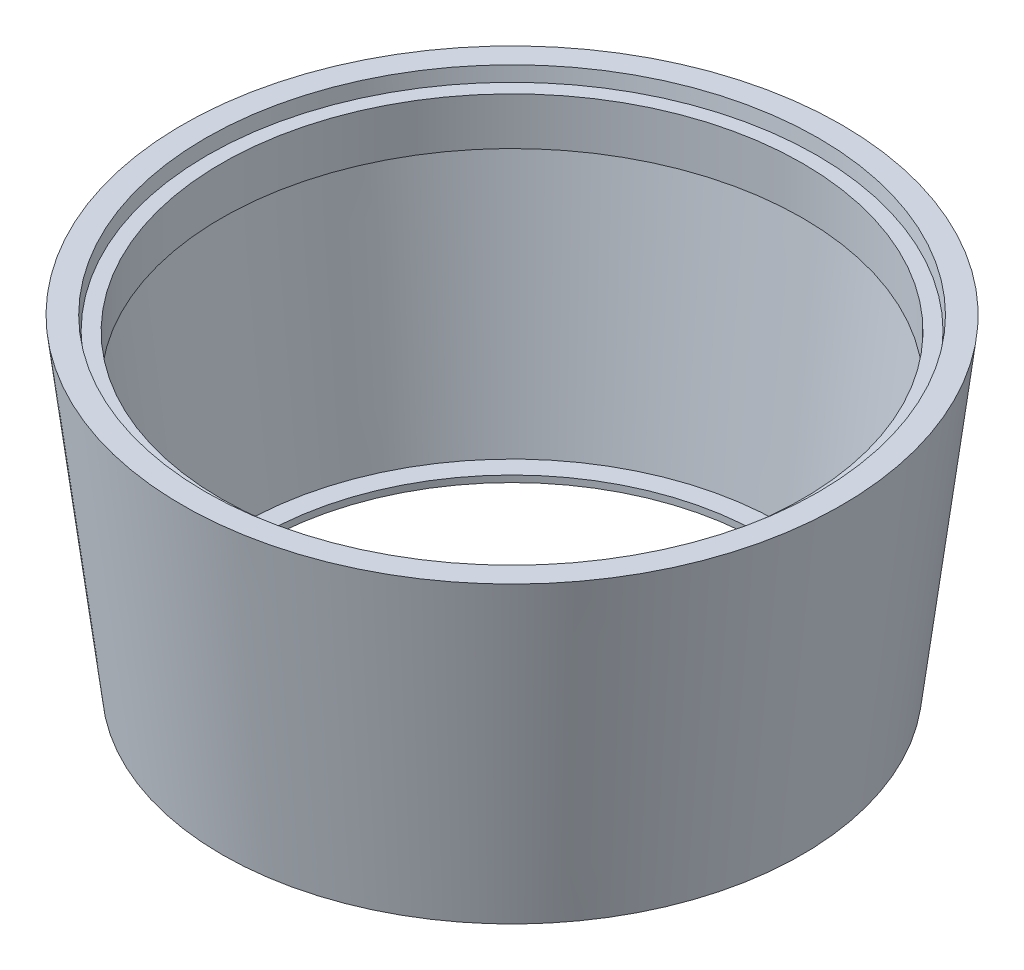
ISO-10303-21;
HEADER;
FILE_DESCRIPTION(('STEP AP214'),'2;1');
FILE_NAME('part.step','',(''),(''),'','','');
FILE_SCHEMA(('AUTOMOTIVE_DESIGN { 1 0 10303 214 1 1 1 1 }'));
ENDSEC;
DATA;
#1=APPLICATION_CONTEXT('core data for automotive mechanical design processes');
#2=APPLICATION_PROTOCOL_DEFINITION('international standard','automotive_design',2000,#1);
#3=PRODUCT_CONTEXT('',#1,'mechanical');
#4=PRODUCT('Part','Part','',(#3));
#5=PRODUCT_RELATED_PRODUCT_CATEGORY('part','',(#4));
#6=PRODUCT_DEFINITION_FORMATION('','',#4);
#7=PRODUCT_DEFINITION_CONTEXT('part definition',#1,'design');
#8=PRODUCT_DEFINITION('design','',#6,#7);
#9=PRODUCT_DEFINITION_SHAPE('','',#8);
#10=(LENGTH_UNIT() NAMED_UNIT(*) SI_UNIT(.MILLI.,.METRE.));
#11=(NAMED_UNIT(*) PLANE_ANGLE_UNIT() SI_UNIT($,.RADIAN.));
#12=(NAMED_UNIT(*) SI_UNIT($,.STERADIAN.) SOLID_ANGLE_UNIT());
#13=UNCERTAINTY_MEASURE_WITH_UNIT(LENGTH_MEASURE(1.E-05),#10,'distance_accuracy_value','');
#14=(GEOMETRIC_REPRESENTATION_CONTEXT(3) GLOBAL_UNCERTAINTY_ASSIGNED_CONTEXT((#13)) GLOBAL_UNIT_ASSIGNED_CONTEXT((#10,
#11,#12)) REPRESENTATION_CONTEXT('',''));
#15=CARTESIAN_POINT('',(0.,0.,0.));
#16=DIRECTION('',(0.,0.,1.));
#17=DIRECTION('',(1.,0.,0.));
#18=AXIS2_PLACEMENT_3D('',#15,#16,#17);
#19=CARTESIAN_POINT('',(-752.,0.,0.));
#20=DIRECTION('',(0.,-1.,0.));
#21=DIRECTION('',(0.,0.,-1.));
#22=AXIS2_PLACEMENT_3D('',#19,#20,#21);
#23=CYLINDRICAL_SURFACE('',#22,534.865140112016);
#24=CARTESIAN_POINT('',(-752.,0.,0.));
#25=DIRECTION('',(0.,-1.,0.));
#26=DIRECTION('',(0.,0.,-1.));
#27=AXIS2_PLACEMENT_3D('',#24,#25,#26);
#28=CIRCLE('',#27,534.865140112016);
#29=CARTESIAN_POINT('',(-752.,0.,-534.865140112016));
#30=VERTEX_POINT('',#29);
#31=EDGE_CURVE('E67',#30,#30,#28,.T.);
#32=ORIENTED_EDGE('',*,*,#31,.T.);
#33=EDGE_LOOP('',(#32));
#34=FACE_BOUND('',#33,.T.);
#35=CARTESIAN_POINT('',(-752.,14.,0.));
#36=DIRECTION('',(0.,-1.,0.));
#37=DIRECTION('',(0.,0.,-1.));
#38=AXIS2_PLACEMENT_3D('',#35,#36,#37);
#39=CIRCLE('',#38,534.865140112016);
#40=CARTESIAN_POINT('',(-752.,14.,-534.865140112016));
#41=VERTEX_POINT('',#40);
#42=EDGE_CURVE('E10',#41,#41,#39,.T.);
#43=ORIENTED_EDGE('',*,*,#42,.F.);
#44=EDGE_LOOP('',(#43));
#45=FACE_BOUND('',#44,.T.);
#46=ADVANCED_FACE('F33',(#34,#45),#23,.F.);
#47=CARTESIAN_POINT('',(-217.134859887985,14.,0.));
#48=DIRECTION('',(0.,1.,0.));
#49=DIRECTION('',(0.,0.,1.));
#50=AXIS2_PLACEMENT_3D('',#47,#48,#49);
#51=PLANE('',#50);
#52=ORIENTED_EDGE('',*,*,#42,.T.);
#53=EDGE_LOOP('',(#52));
#54=FACE_BOUND('',#53,.T.);
#55=CARTESIAN_POINT('',(-752.,14.,0.));
#56=DIRECTION('',(0.,-1.,0.));
#57=DIRECTION('',(0.,0.,-1.));
#58=AXIS2_PLACEMENT_3D('',#55,#56,#57);
#59=CIRCLE('',#58,576.49491067086);
#60=CARTESIAN_POINT('',(-752.,14.,-576.49491067086));
#61=VERTEX_POINT('',#60);
#62=EDGE_CURVE('E39',#61,#61,#59,.T.);
#63=ORIENTED_EDGE('',*,*,#62,.F.);
#64=EDGE_LOOP('',(#63));
#65=FACE_BOUND('',#64,.T.);
#66=ADVANCED_FACE('F85',(#54,#65),#51,.T.);
#67=CARTESIAN_POINT('',(-752.,557.028191997716,0.));
#68=DIRECTION('',(0.,1.,0.));
#69=DIRECTION('',(0.,0.,1.));
#70=AXIS2_PLACEMENT_3D('',#67,#68,#69);
#71=CONICAL_SURFACE('',#70,643.170388783196,0.122173047639599);
#72=ORIENTED_EDGE('',*,*,#62,.T.);
#73=EDGE_LOOP('',(#72));
#74=FACE_BOUND('',#73,.T.);
#75=CARTESIAN_POINT('',(-752.,557.028191997716,0.));
#76=DIRECTION('',(0.,-1.,0.));
#77=DIRECTION('',(0.,0.,-1.));
#78=AXIS2_PLACEMENT_3D('',#75,#76,#77);
#79=CIRCLE('',#78,643.170388783196);
#80=CARTESIAN_POINT('',(-752.,557.028191997716,-643.170388783196));
#81=VERTEX_POINT('',#80);
#82=EDGE_CURVE('E43',#81,#81,#79,.T.);
#83=ORIENTED_EDGE('',*,*,#82,.F.);
#84=EDGE_LOOP('',(#83));
#85=FACE_BOUND('',#84,.T.);
#86=ADVANCED_FACE('F89',(#74,#85),#71,.F.);
#87=CARTESIAN_POINT('',(-131.977387408455,557.028191997716,0.));
#88=DIRECTION('',(0.,-1.,0.));
#89=DIRECTION('',(0.,0.,-1.));
#90=AXIS2_PLACEMENT_3D('',#87,#88,#89);
#91=PLANE('',#90);
#92=ORIENTED_EDGE('',*,*,#82,.T.);
#93=EDGE_LOOP('',(#92));
#94=FACE_BOUND('',#93,.T.);
#95=CARTESIAN_POINT('',(-752.,557.028191997716,0.));
#96=DIRECTION('',(0.,-1.,0.));
#97=DIRECTION('',(0.,0.,-1.));
#98=AXIS2_PLACEMENT_3D('',#95,#96,#97);
#99=CIRCLE('',#98,620.022612591545);
#100=CARTESIAN_POINT('',(-752.,557.028191997716,-620.022612591545));
#101=VERTEX_POINT('',#100);
#102=EDGE_CURVE('E47',#101,#101,#99,.T.);
#103=ORIENTED_EDGE('',*,*,#102,.F.);
#104=EDGE_LOOP('',(#103));
#105=FACE_BOUND('',#104,.T.);
#106=ADVANCED_FACE('F93',(#94,#105),#91,.T.);
#107=CARTESIAN_POINT('',(-752.,0.,0.));
#108=DIRECTION('',(0.,-1.,0.));
#109=DIRECTION('',(0.,0.,-1.));
#110=AXIS2_PLACEMENT_3D('',#107,#108,#109);
#111=CYLINDRICAL_SURFACE('',#110,620.022612591545);
#112=ORIENTED_EDGE('',*,*,#102,.T.);
#113=EDGE_LOOP('',(#112));
#114=FACE_BOUND('',#113,.T.);
#115=CARTESIAN_POINT('',(-752.,658.058098538197,0.));
#116=DIRECTION('',(0.,-1.,0.));
#117=DIRECTION('',(0.,0.,-1.));
#118=AXIS2_PLACEMENT_3D('',#115,#116,#117);
#119=CIRCLE('',#118,620.022612591545);
#120=CARTESIAN_POINT('',(-752.,658.058098538197,-620.022612591545));
#121=VERTEX_POINT('',#120);
#122=EDGE_CURVE('E52',#121,#121,#119,.T.);
#123=ORIENTED_EDGE('',*,*,#122,.F.);
#124=EDGE_LOOP('',(#123));
#125=FACE_BOUND('',#124,.T.);
#126=ADVANCED_FACE('F99',(#114,#125),#111,.F.);
#127=CARTESIAN_POINT('',(-101.754105256252,658.058098538197,0.));
#128=DIRECTION('',(0.,1.,0.));
#129=DIRECTION('',(0.,0.,1.));
#130=AXIS2_PLACEMENT_3D('',#127,#128,#129);
#131=PLANE('',#130);
#132=ORIENTED_EDGE('',*,*,#122,.T.);
#133=EDGE_LOOP('',(#132));
#134=FACE_BOUND('',#133,.T.);
#135=CARTESIAN_POINT('',(-752.,658.058098538197,0.));
#136=DIRECTION('',(0.,-1.,0.));
#137=DIRECTION('',(0.,0.,-1.));
#138=AXIS2_PLACEMENT_3D('',#135,#136,#137);
#139=CIRCLE('',#138,650.245894743748);
#140=CARTESIAN_POINT('',(-752.,658.058098538197,-650.245894743748));
#141=VERTEX_POINT('',#140);
#142=EDGE_CURVE('E55',#141,#141,#139,.T.);
#143=ORIENTED_EDGE('',*,*,#142,.F.);
#144=EDGE_LOOP('',(#143));
#145=FACE_BOUND('',#144,.T.);
#146=ADVANCED_FACE('F103',(#134,#145),#131,.T.);
#147=CARTESIAN_POINT('',(-752.,687.834483087436,0.));
#148=DIRECTION('',(0.,1.,0.));
#149=DIRECTION('',(0.,0.,1.));
#150=AXIS2_PLACEMENT_3D('',#147,#148,#149);
#151=CONICAL_SURFACE('',#150,653.901975045903,0.122173047639597);
#152=ORIENTED_EDGE('',*,*,#142,.T.);
#153=EDGE_LOOP('',(#152));
#154=FACE_BOUND('',#153,.T.);
#155=CARTESIAN_POINT('',(-752.,687.834483087436,0.));
#156=DIRECTION('',(0.,-1.,0.));
#157=DIRECTION('',(0.,0.,-1.));
#158=AXIS2_PLACEMENT_3D('',#155,#156,#157);
#159=CIRCLE('',#158,653.901975045903);
#160=CARTESIAN_POINT('',(-752.,687.834483087436,-653.901975045903));
#161=VERTEX_POINT('',#160);
#162=EDGE_CURVE('E58',#161,#161,#159,.T.);
#163=ORIENTED_EDGE('',*,*,#162,.F.);
#164=EDGE_LOOP('',(#163));
#165=FACE_BOUND('',#164,.T.);
#166=ADVANCED_FACE('F107',(#154,#165),#151,.F.);
#167=CARTESIAN_POINT('',(-48.8047787689721,687.834483087436,0.));
#168=DIRECTION('',(0.,1.,0.));
#169=DIRECTION('',(0.,0.,1.));
#170=AXIS2_PLACEMENT_3D('',#167,#168,#169);
#171=PLANE('',#170);
#172=ORIENTED_EDGE('',*,*,#162,.T.);
#173=EDGE_LOOP('',(#172));
#174=FACE_BOUND('',#173,.T.);
#175=CARTESIAN_POINT('',(-752.,687.834483087436,0.));
#176=DIRECTION('',(0.,-1.,0.));
#177=DIRECTION('',(0.,0.,-1.));
#178=AXIS2_PLACEMENT_3D('',#175,#176,#177);
#179=CIRCLE('',#178,703.195221231028);
#180=CARTESIAN_POINT('',(-752.,687.834483087436,-703.195221231028));
#181=VERTEX_POINT('',#180);
#182=EDGE_CURVE('E61',#181,#181,#179,.T.);
#183=ORIENTED_EDGE('',*,*,#182,.F.);
#184=EDGE_LOOP('',(#183));
#185=FACE_BOUND('',#184,.T.);
#186=ADVANCED_FACE('F81',(#174,#185),#171,.T.);
#187=CARTESIAN_POINT('',(-752.,0.,0.));
#188=DIRECTION('',(0.,1.,0.));
#189=DIRECTION('',(0.,0.,1.));
#190=AXIS2_PLACEMENT_3D('',#187,#188,#189);
#191=CONICAL_SURFACE('',#190,618.739766251263,0.1221730476396);
#192=ORIENTED_EDGE('',*,*,#182,.T.);
#193=EDGE_LOOP('',(#192));
#194=FACE_BOUND('',#193,.T.);
#195=CARTESIAN_POINT('',(-752.,0.,0.));
#196=DIRECTION('',(0.,-1.,0.));
#197=DIRECTION('',(0.,0.,-1.));
#198=AXIS2_PLACEMENT_3D('',#195,#196,#197);
#199=CIRCLE('',#198,618.739766251263);
#200=CARTESIAN_POINT('',(-752.,0.,-618.739766251263));
#201=VERTEX_POINT('',#200);
#202=EDGE_CURVE('E64',#201,#201,#199,.T.);
#203=ORIENTED_EDGE('',*,*,#202,.F.);
#204=EDGE_LOOP('',(#203));
#205=FACE_BOUND('',#204,.T.);
#206=ADVANCED_FACE('F75',(#194,#205),#191,.T.);
#207=CARTESIAN_POINT('',(-217.134859887985,0.,0.));
#208=DIRECTION('',(0.,-1.,0.));
#209=DIRECTION('',(0.,0.,-1.));
#210=AXIS2_PLACEMENT_3D('',#207,#208,#209);
#211=PLANE('',#210);
#212=ORIENTED_EDGE('',*,*,#202,.T.);
#213=EDGE_LOOP('',(#212));
#214=FACE_BOUND('',#213,.T.);
#215=ORIENTED_EDGE('',*,*,#31,.F.);
#216=EDGE_LOOP('',(#215));
#217=FACE_BOUND('',#216,.T.);
#218=ADVANCED_FACE('F73',(#214,#217),#211,.T.);
#219=CLOSED_SHELL('',(#46,#66,#86,#106,#126,#146,#166,#186,#206,#218));
#220=MANIFOLD_SOLID_BREP('B2',#219);
#221=ADVANCED_BREP_SHAPE_REPRESENTATION('',(#18,#220),#14);
#222=SHAPE_DEFINITION_REPRESENTATION(#9,#221);
ENDSEC;
END-ISO-10303-21;
